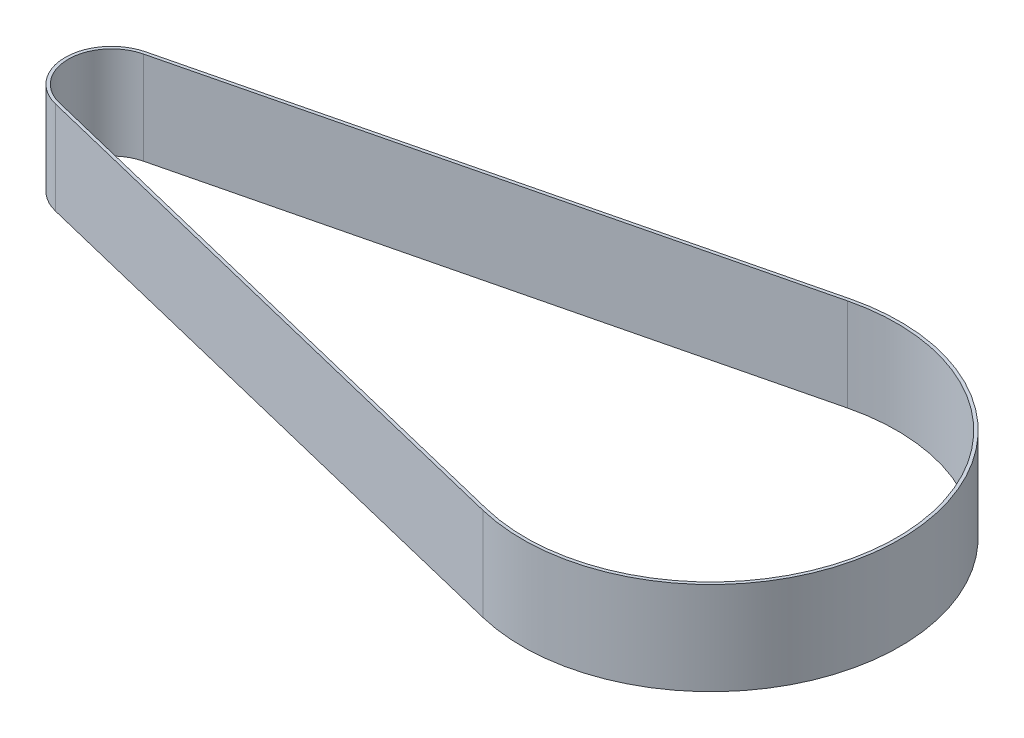
ISO-10303-21;
HEADER;
FILE_DESCRIPTION(('STEP AP214'),'2;1');
FILE_NAME('part.step','',(''),(''),'','','');
FILE_SCHEMA(('AUTOMOTIVE_DESIGN { 1 0 10303 214 1 1 1 1 }'));
ENDSEC;
DATA;
#1=APPLICATION_CONTEXT('core data for automotive mechanical design processes');
#2=APPLICATION_PROTOCOL_DEFINITION('international standard','automotive_design',2000,#1);
#3=PRODUCT_CONTEXT('',#1,'mechanical');
#4=PRODUCT('Part','Part','',(#3));
#5=PRODUCT_RELATED_PRODUCT_CATEGORY('part','',(#4));
#6=PRODUCT_DEFINITION_FORMATION('','',#4);
#7=PRODUCT_DEFINITION_CONTEXT('part definition',#1,'design');
#8=PRODUCT_DEFINITION('design','',#6,#7);
#9=PRODUCT_DEFINITION_SHAPE('','',#8);
#10=(LENGTH_UNIT() NAMED_UNIT(*) SI_UNIT(.MILLI.,.METRE.));
#11=(NAMED_UNIT(*) PLANE_ANGLE_UNIT() SI_UNIT($,.RADIAN.));
#12=(NAMED_UNIT(*) SI_UNIT($,.STERADIAN.) SOLID_ANGLE_UNIT());
#13=UNCERTAINTY_MEASURE_WITH_UNIT(LENGTH_MEASURE(1.E-05),#10,'distance_accuracy_value','');
#14=(GEOMETRIC_REPRESENTATION_CONTEXT(3) GLOBAL_UNCERTAINTY_ASSIGNED_CONTEXT((#13)) GLOBAL_UNIT_ASSIGNED_CONTEXT((#10,
#11,#12)) REPRESENTATION_CONTEXT('',''));
#15=CARTESIAN_POINT('',(0.,0.,0.));
#16=DIRECTION('',(0.,0.,1.));
#17=DIRECTION('',(1.,0.,0.));
#18=AXIS2_PLACEMENT_3D('',#15,#16,#17);
#19=CARTESIAN_POINT('',(-175.502494652181,15.,-122.342465314125));
#20=DIRECTION('',(0.,1.,0.));
#21=DIRECTION('',(0.,0.,1.));
#22=AXIS2_PLACEMENT_3D('',#19,#20,#21);
#23=PLANE('',#22);
#24=CARTESIAN_POINT('',(-175.502494652181,15.,-122.342465314125));
#25=DIRECTION('',(0.,1.,0.));
#26=DIRECTION('',(0.,0.,1.));
#27=AXIS2_PLACEMENT_3D('',#24,#25,#26);
#28=CIRCLE('',#27,30.5000000000001);
#29=CARTESIAN_POINT('',(-182.741668223523,15.,-92.7140268469363));
#30=VERTEX_POINT('',#29);
#31=CARTESIAN_POINT('',(-182.741668223548,15.,-151.970903781308));
#32=VERTEX_POINT('',#31);
#33=EDGE_CURVE('E153',#30,#32,#28,.T.);
#34=ORIENTED_EDGE('',*,*,#33,.T.);
#35=DIRECTION('',(-0.971424212038773,0.,0.23734995315957));
#36=VECTOR('',#35,1.);
#37=CARTESIAN_POINT('',(-182.741668223548,15.,-151.970903781308));
#38=LINE('',#37,#36);
#39=CARTESIAN_POINT('',(-274.185945776687,15.,-129.628146904375));
#40=VERTEX_POINT('',#39);
#41=EDGE_CURVE('E157',#32,#40,#38,.T.);
#42=ORIENTED_EDGE('',*,*,#41,.T.);
#43=CARTESIAN_POINT('',(-272.40582112799,15.,-122.342465314084));
#44=DIRECTION('',(0.,1.,0.));
#45=DIRECTION('',(0.,0.,1.));
#46=AXIS2_PLACEMENT_3D('',#43,#44,#45);
#47=CIRCLE('',#46,7.50000000000004);
#48=CARTESIAN_POINT('',(-274.185945776681,15.,-115.056783723792));
#49=VERTEX_POINT('',#48);
#50=EDGE_CURVE('E161',#40,#49,#47,.T.);
#51=ORIENTED_EDGE('',*,*,#50,.T.);
#52=DIRECTION('',(0.971424212038973,0.,0.23734995315875));
#53=VECTOR('',#52,1.);
#54=CARTESIAN_POINT('',(-274.185945776681,15.,-115.056783723792));
#55=LINE('',#54,#53);
#56=EDGE_CURVE('E164',#49,#30,#55,.T.);
#57=ORIENTED_EDGE('',*,*,#56,.T.);
#58=EDGE_LOOP('',(#34,#42,#51,#57));
#59=FACE_BOUND('',#58,.T.);
#60=DIRECTION('',(0.971424212038973,0.,0.237349953158749));
#61=VECTOR('',#60,1.);
#62=CARTESIAN_POINT('',(-182.622993246943,15.,-93.1997389529558));
#63=LINE('',#62,#61);
#64=CARTESIAN_POINT('',(-274.067270800101,15.,-115.542495829811));
#65=VERTEX_POINT('',#64);
#66=CARTESIAN_POINT('',(-182.622993246943,15.,-93.1997389529558));
#67=VERTEX_POINT('',#66);
#68=EDGE_CURVE('E114',#65,#67,#63,.T.);
#69=ORIENTED_EDGE('',*,*,#68,.F.);
#70=CARTESIAN_POINT('',(-272.40582112799,15.,-122.342465314084));
#71=DIRECTION('',(0.,1.,0.));
#72=DIRECTION('',(0.,0.,1.));
#73=AXIS2_PLACEMENT_3D('',#70,#71,#72);
#74=CIRCLE('',#73,7.00000000000004);
#75=CARTESIAN_POINT('',(-274.067270800107,15.,-129.142434798356));
#76=VERTEX_POINT('',#75);
#77=EDGE_CURVE('E105',#76,#65,#74,.T.);
#78=ORIENTED_EDGE('',*,*,#77,.F.);
#79=DIRECTION('',(-0.971424212038772,0.,0.23734995315957));
#80=VECTOR('',#79,1.);
#81=CARTESIAN_POINT('',(-274.067270800107,15.,-129.142434798356));
#82=LINE('',#81,#80);
#83=CARTESIAN_POINT('',(-182.622993246968,15.,-151.485191675288));
#84=VERTEX_POINT('',#83);
#85=EDGE_CURVE('E131',#84,#76,#82,.T.);
#86=ORIENTED_EDGE('',*,*,#85,.F.);
#87=CARTESIAN_POINT('',(-175.502494652181,15.,-122.342465314125));
#88=DIRECTION('',(0.,1.,0.));
#89=DIRECTION('',(0.,0.,1.));
#90=AXIS2_PLACEMENT_3D('',#87,#88,#89);
#91=CIRCLE('',#90,30.0000000000001);
#92=EDGE_CURVE('E127',#67,#84,#91,.T.);
#93=ORIENTED_EDGE('',*,*,#92,.F.);
#94=EDGE_LOOP('',(#69,#78,#86,#93));
#95=FACE_BOUND('',#94,.T.);
#96=ADVANCED_FACE('F39',(#59,#95),#23,.T.);
#97=CARTESIAN_POINT('',(-175.502494652181,0.,-122.342465314125));
#98=DIRECTION('',(0.,1.,0.));
#99=DIRECTION('',(0.,0.,1.));
#100=AXIS2_PLACEMENT_3D('',#97,#98,#99);
#101=PLANE('',#100);
#102=CARTESIAN_POINT('',(-175.502494652181,0.,-122.342465314125));
#103=DIRECTION('',(0.,1.,0.));
#104=DIRECTION('',(0.,0.,1.));
#105=AXIS2_PLACEMENT_3D('',#102,#103,#104);
#106=CIRCLE('',#105,30.5000000000001);
#107=CARTESIAN_POINT('',(-182.741668223523,0.,-92.7140268469363));
#108=VERTEX_POINT('',#107);
#109=CARTESIAN_POINT('',(-182.741668223548,0.,-151.970903781308));
#110=VERTEX_POINT('',#109);
#111=EDGE_CURVE('E123',#108,#110,#106,.T.);
#112=ORIENTED_EDGE('',*,*,#111,.F.);
#113=DIRECTION('',(0.971424212038973,0.,0.23734995315875));
#114=VECTOR('',#113,1.);
#115=CARTESIAN_POINT('',(-274.185945776681,0.,-115.056783723792));
#116=LINE('',#115,#114);
#117=CARTESIAN_POINT('',(-274.185945776681,0.,-115.056783723792));
#118=VERTEX_POINT('',#117);
#119=EDGE_CURVE('E158',#118,#108,#116,.T.);
#120=ORIENTED_EDGE('',*,*,#119,.F.);
#121=CARTESIAN_POINT('',(-272.40582112799,0.,-122.342465314084));
#122=DIRECTION('',(0.,1.,0.));
#123=DIRECTION('',(0.,0.,1.));
#124=AXIS2_PLACEMENT_3D('',#121,#122,#123);
#125=CIRCLE('',#124,7.50000000000004);
#126=CARTESIAN_POINT('',(-274.185945776687,0.,-129.628146904375));
#127=VERTEX_POINT('',#126);
#128=EDGE_CURVE('E174',#127,#118,#125,.T.);
#129=ORIENTED_EDGE('',*,*,#128,.F.);
#130=DIRECTION('',(-0.971424212038773,0.,0.23734995315957));
#131=VECTOR('',#130,1.);
#132=CARTESIAN_POINT('',(-182.741668223548,0.,-151.970903781308));
#133=LINE('',#132,#131);
#134=EDGE_CURVE('E171',#110,#127,#133,.T.);
#135=ORIENTED_EDGE('',*,*,#134,.F.);
#136=EDGE_LOOP('',(#112,#120,#129,#135));
#137=FACE_BOUND('',#136,.T.);
#138=CARTESIAN_POINT('',(-272.40582112799,0.,-122.342465314084));
#139=DIRECTION('',(0.,1.,0.));
#140=DIRECTION('',(0.,0.,1.));
#141=AXIS2_PLACEMENT_3D('',#138,#139,#140);
#142=CIRCLE('',#141,7.00000000000004);
#143=CARTESIAN_POINT('',(-274.067270800107,0.,-129.142434798356));
#144=VERTEX_POINT('',#143);
#145=CARTESIAN_POINT('',(-274.067270800101,0.,-115.542495829811));
#146=VERTEX_POINT('',#145);
#147=EDGE_CURVE('E63',#144,#146,#142,.T.);
#148=ORIENTED_EDGE('',*,*,#147,.T.);
#149=DIRECTION('',(0.971424212038973,0.,0.237349953158749));
#150=VECTOR('',#149,1.);
#151=CARTESIAN_POINT('',(-182.622993246943,0.,-93.1997389529558));
#152=LINE('',#151,#150);
#153=CARTESIAN_POINT('',(-182.622993246943,0.,-93.1997389529558));
#154=VERTEX_POINT('',#153);
#155=EDGE_CURVE('E121',#146,#154,#152,.T.);
#156=ORIENTED_EDGE('',*,*,#155,.T.);
#157=CARTESIAN_POINT('',(-175.502494652181,0.,-122.342465314125));
#158=DIRECTION('',(0.,1.,0.));
#159=DIRECTION('',(0.,0.,1.));
#160=AXIS2_PLACEMENT_3D('',#157,#158,#159);
#161=CIRCLE('',#160,30.0000000000001);
#162=CARTESIAN_POINT('',(-182.622993246968,0.,-151.485191675288));
#163=VERTEX_POINT('',#162);
#164=EDGE_CURVE('E140',#154,#163,#161,.T.);
#165=ORIENTED_EDGE('',*,*,#164,.T.);
#166=DIRECTION('',(-0.971424212038772,0.,0.23734995315957));
#167=VECTOR('',#166,1.);
#168=CARTESIAN_POINT('',(-274.067270800107,0.,-129.142434798356));
#169=LINE('',#168,#167);
#170=EDGE_CURVE('E115',#163,#144,#169,.T.);
#171=ORIENTED_EDGE('',*,*,#170,.T.);
#172=EDGE_LOOP('',(#148,#156,#165,#171));
#173=FACE_BOUND('',#172,.T.);
#174=ADVANCED_FACE('F197',(#137,#173),#101,.F.);
#175=CARTESIAN_POINT('',(-175.502494652181,15.,-122.342465314125));
#176=DIRECTION('',(0.,-1.,0.));
#177=DIRECTION('',(0.,0.,-1.));
#178=AXIS2_PLACEMENT_3D('',#175,#176,#177);
#179=CYLINDRICAL_SURFACE('',#178,30.5000000000001);
#180=ORIENTED_EDGE('',*,*,#111,.T.);
#181=DIRECTION('',(0.,-1.,0.));
#182=VECTOR('',#181,1.);
#183=CARTESIAN_POINT('',(-182.741668223548,15.,-151.970903781308));
#184=LINE('',#183,#182);
#185=EDGE_CURVE('E11',#32,#110,#184,.T.);
#186=ORIENTED_EDGE('',*,*,#185,.F.);
#187=ORIENTED_EDGE('',*,*,#33,.F.);
#188=DIRECTION('',(0.,-1.,0.));
#189=VECTOR('',#188,1.);
#190=CARTESIAN_POINT('',(-182.741668223523,15.,-92.7140268469363));
#191=LINE('',#190,#189);
#192=EDGE_CURVE('E167',#30,#108,#191,.T.);
#193=ORIENTED_EDGE('',*,*,#192,.T.);
#194=EDGE_LOOP('',(#180,#186,#187,#193));
#195=FACE_BOUND('',#194,.T.);
#196=ADVANCED_FACE('F41',(#195),#179,.T.);
#197=CARTESIAN_POINT('',(-182.741668223548,15.,-151.970903781308));
#198=DIRECTION('',(0.23734995315957,0.,0.971424212038772));
#199=DIRECTION('',(0.971424212038773,0.,-0.23734995315957));
#200=AXIS2_PLACEMENT_3D('',#197,#198,#199);
#201=PLANE('',#200);
#202=ORIENTED_EDGE('',*,*,#134,.T.);
#203=DIRECTION('',(0.,-1.,0.));
#204=VECTOR('',#203,1.);
#205=CARTESIAN_POINT('',(-274.185945776687,15.,-129.628146904375));
#206=LINE('',#205,#204);
#207=EDGE_CURVE('E48',#40,#127,#206,.T.);
#208=ORIENTED_EDGE('',*,*,#207,.F.);
#209=ORIENTED_EDGE('',*,*,#41,.F.);
#210=ORIENTED_EDGE('',*,*,#185,.T.);
#211=EDGE_LOOP('',(#202,#208,#209,#210));
#212=FACE_BOUND('',#211,.T.);
#213=ADVANCED_FACE('F207',(#212),#201,.F.);
#214=CARTESIAN_POINT('',(-272.40582112799,15.,-122.342465314084));
#215=DIRECTION('',(0.,-1.,0.));
#216=DIRECTION('',(0.,0.,-1.));
#217=AXIS2_PLACEMENT_3D('',#214,#215,#216);
#218=CYLINDRICAL_SURFACE('',#217,7.50000000000004);
#219=ORIENTED_EDGE('',*,*,#128,.T.);
#220=DIRECTION('',(0.,-1.,0.));
#221=VECTOR('',#220,1.);
#222=CARTESIAN_POINT('',(-274.185945776681,15.,-115.056783723792));
#223=LINE('',#222,#221);
#224=EDGE_CURVE('E182',#49,#118,#223,.T.);
#225=ORIENTED_EDGE('',*,*,#224,.F.);
#226=ORIENTED_EDGE('',*,*,#50,.F.);
#227=ORIENTED_EDGE('',*,*,#207,.T.);
#228=EDGE_LOOP('',(#219,#225,#226,#227));
#229=FACE_BOUND('',#228,.T.);
#230=ADVANCED_FACE('F191',(#229),#218,.T.);
#231=CARTESIAN_POINT('',(-274.185945776681,15.,-115.056783723792));
#232=DIRECTION('',(0.23734995315875,0.,-0.971424212038973));
#233=DIRECTION('',(-0.971424212038973,0.,-0.23734995315875));
#234=AXIS2_PLACEMENT_3D('',#231,#232,#233);
#235=PLANE('',#234);
#236=ORIENTED_EDGE('',*,*,#119,.T.);
#237=ORIENTED_EDGE('',*,*,#192,.F.);
#238=ORIENTED_EDGE('',*,*,#56,.F.);
#239=ORIENTED_EDGE('',*,*,#224,.T.);
#240=EDGE_LOOP('',(#236,#237,#238,#239));
#241=FACE_BOUND('',#240,.T.);
#242=ADVANCED_FACE('F201',(#241),#235,.F.);
#243=CARTESIAN_POINT('',(-272.40582112799,15.,-122.342465314084));
#244=DIRECTION('',(0.,-1.,0.));
#245=DIRECTION('',(0.,0.,-1.));
#246=AXIS2_PLACEMENT_3D('',#243,#244,#245);
#247=CYLINDRICAL_SURFACE('',#246,7.00000000000004);
#248=ORIENTED_EDGE('',*,*,#147,.F.);
#249=DIRECTION('',(0.,-1.,0.));
#250=VECTOR('',#249,1.);
#251=CARTESIAN_POINT('',(-274.067270800107,15.,-129.142434798356));
#252=LINE('',#251,#250);
#253=EDGE_CURVE('E109',#76,#144,#252,.T.);
#254=ORIENTED_EDGE('',*,*,#253,.F.);
#255=ORIENTED_EDGE('',*,*,#77,.T.);
#256=DIRECTION('',(0.,-1.,0.));
#257=VECTOR('',#256,1.);
#258=CARTESIAN_POINT('',(-274.067270800101,15.,-115.542495829811));
#259=LINE('',#258,#257);
#260=EDGE_CURVE('E108',#65,#146,#259,.T.);
#261=ORIENTED_EDGE('',*,*,#260,.T.);
#262=EDGE_LOOP('',(#248,#254,#255,#261));
#263=FACE_BOUND('',#262,.T.);
#264=ADVANCED_FACE('F107',(#263),#247,.F.);
#265=CARTESIAN_POINT('',(-182.622993246943,15.,-93.1997389529558));
#266=DIRECTION('',(0.237349953158749,0.,-0.971424212038973));
#267=DIRECTION('',(-0.971424212038973,0.,-0.237349953158749));
#268=AXIS2_PLACEMENT_3D('',#265,#266,#267);
#269=PLANE('',#268);
#270=ORIENTED_EDGE('',*,*,#155,.F.);
#271=ORIENTED_EDGE('',*,*,#260,.F.);
#272=ORIENTED_EDGE('',*,*,#68,.T.);
#273=DIRECTION('',(0.,-1.,0.));
#274=VECTOR('',#273,1.);
#275=CARTESIAN_POINT('',(-182.622993246943,15.,-93.1997389529558));
#276=LINE('',#275,#274);
#277=EDGE_CURVE('E124',#67,#154,#276,.T.);
#278=ORIENTED_EDGE('',*,*,#277,.T.);
#279=EDGE_LOOP('',(#270,#271,#272,#278));
#280=FACE_BOUND('',#279,.T.);
#281=ADVANCED_FACE('F118',(#280),#269,.T.);
#282=CARTESIAN_POINT('',(-175.502494652181,15.,-122.342465314125));
#283=DIRECTION('',(0.,-1.,0.));
#284=DIRECTION('',(0.,0.,-1.));
#285=AXIS2_PLACEMENT_3D('',#282,#283,#284);
#286=CYLINDRICAL_SURFACE('',#285,30.0000000000001);
#287=ORIENTED_EDGE('',*,*,#164,.F.);
#288=ORIENTED_EDGE('',*,*,#277,.F.);
#289=ORIENTED_EDGE('',*,*,#92,.T.);
#290=DIRECTION('',(0.,-1.,0.));
#291=VECTOR('',#290,1.);
#292=CARTESIAN_POINT('',(-182.622993246968,15.,-151.485191675288));
#293=LINE('',#292,#291);
#294=EDGE_CURVE('E55',#84,#163,#293,.T.);
#295=ORIENTED_EDGE('',*,*,#294,.T.);
#296=EDGE_LOOP('',(#287,#288,#289,#295));
#297=FACE_BOUND('',#296,.T.);
#298=ADVANCED_FACE('F230',(#297),#286,.F.);
#299=CARTESIAN_POINT('',(-274.067270800107,15.,-129.142434798356));
#300=DIRECTION('',(0.23734995315957,0.,0.971424212038772));
#301=DIRECTION('',(0.971424212038772,0.,-0.23734995315957));
#302=AXIS2_PLACEMENT_3D('',#299,#300,#301);
#303=PLANE('',#302);
#304=ORIENTED_EDGE('',*,*,#170,.F.);
#305=ORIENTED_EDGE('',*,*,#294,.F.);
#306=ORIENTED_EDGE('',*,*,#85,.T.);
#307=ORIENTED_EDGE('',*,*,#253,.T.);
#308=EDGE_LOOP('',(#304,#305,#306,#307));
#309=FACE_BOUND('',#308,.T.);
#310=ADVANCED_FACE('F234',(#309),#303,.T.);
#311=CLOSED_SHELL('',(#96,#174,#196,#213,#230,#242,#264,#281,#298,#310));
#312=MANIFOLD_SOLID_BREP('B2',#311);
#313=ADVANCED_BREP_SHAPE_REPRESENTATION('',(#18,#312),#14);
#314=SHAPE_DEFINITION_REPRESENTATION(#9,#313);
ENDSEC;
END-ISO-10303-21;
